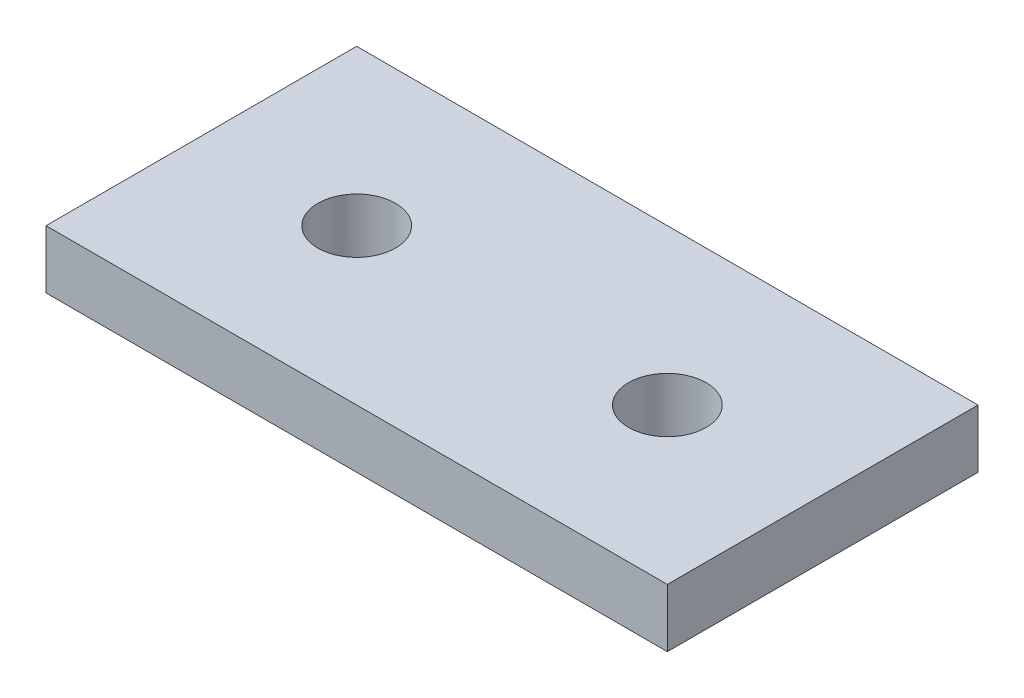
ISO-10303-21;
HEADER;
FILE_DESCRIPTION(('STEP AP214'),'2;1');
FILE_NAME('part.step','',(''),(''),'','','');
FILE_SCHEMA(('AUTOMOTIVE_DESIGN { 1 0 10303 214 1 1 1 1 }'));
ENDSEC;
DATA;
#1=APPLICATION_CONTEXT('core data for automotive mechanical design processes');
#2=APPLICATION_PROTOCOL_DEFINITION('international standard','automotive_design',2000,#1);
#3=PRODUCT_CONTEXT('',#1,'mechanical');
#4=PRODUCT('Part','Part','',(#3));
#5=PRODUCT_RELATED_PRODUCT_CATEGORY('part','',(#4));
#6=PRODUCT_DEFINITION_FORMATION('','',#4);
#7=PRODUCT_DEFINITION_CONTEXT('part definition',#1,'design');
#8=PRODUCT_DEFINITION('design','',#6,#7);
#9=PRODUCT_DEFINITION_SHAPE('','',#8);
#10=(LENGTH_UNIT() NAMED_UNIT(*) SI_UNIT(.MILLI.,.METRE.));
#11=(NAMED_UNIT(*) PLANE_ANGLE_UNIT() SI_UNIT($,.RADIAN.));
#12=(NAMED_UNIT(*) SI_UNIT($,.STERADIAN.) SOLID_ANGLE_UNIT());
#13=UNCERTAINTY_MEASURE_WITH_UNIT(LENGTH_MEASURE(1.E-05),#10,'distance_accuracy_value','');
#14=(GEOMETRIC_REPRESENTATION_CONTEXT(3) GLOBAL_UNCERTAINTY_ASSIGNED_CONTEXT((#13)) GLOBAL_UNIT_ASSIGNED_CONTEXT((#10,
#11,#12)) REPRESENTATION_CONTEXT('',''));
#15=CARTESIAN_POINT('',(0.,0.,0.));
#16=DIRECTION('',(0.,0.,1.));
#17=DIRECTION('',(1.,0.,0.));
#18=AXIS2_PLACEMENT_3D('',#15,#16,#17);
#19=CARTESIAN_POINT('',(25.4,2.38125,12.7));
#20=DIRECTION('',(-1.,0.,0.));
#21=DIRECTION('',(0.,0.,1.));
#22=AXIS2_PLACEMENT_3D('',#19,#20,#21);
#23=PLANE('',#22);
#24=DIRECTION('',(0.,0.,-1.));
#25=VECTOR('',#24,1.);
#26=CARTESIAN_POINT('',(25.4,-2.38125,12.7));
#27=LINE('',#26,#25);
#28=CARTESIAN_POINT('',(25.4,-2.38125,12.7));
#29=VERTEX_POINT('',#28);
#30=CARTESIAN_POINT('',(25.4,-2.38125,-12.7));
#31=VERTEX_POINT('',#30);
#32=EDGE_CURVE('E106',#29,#31,#27,.T.);
#33=ORIENTED_EDGE('',*,*,#32,.T.);
#34=DIRECTION('',(0.,-1.,0.));
#35=VECTOR('',#34,1.);
#36=CARTESIAN_POINT('',(25.4,2.38125,-12.7));
#37=LINE('',#36,#35);
#38=CARTESIAN_POINT('',(25.4,2.38125,-12.7));
#39=VERTEX_POINT('',#38);
#40=EDGE_CURVE('E11',#39,#31,#37,.T.);
#41=ORIENTED_EDGE('',*,*,#40,.F.);
#42=DIRECTION('',(0.,0.,-1.));
#43=VECTOR('',#42,1.);
#44=CARTESIAN_POINT('',(25.4,2.38125,12.7));
#45=LINE('',#44,#43);
#46=CARTESIAN_POINT('',(25.4,2.38125,12.7));
#47=VERTEX_POINT('',#46);
#48=EDGE_CURVE('E90',#47,#39,#45,.T.);
#49=ORIENTED_EDGE('',*,*,#48,.F.);
#50=DIRECTION('',(0.,-1.,0.));
#51=VECTOR('',#50,1.);
#52=CARTESIAN_POINT('',(25.4,2.38125,12.7));
#53=LINE('',#52,#51);
#54=EDGE_CURVE('E102',#47,#29,#53,.T.);
#55=ORIENTED_EDGE('',*,*,#54,.T.);
#56=EDGE_LOOP('',(#33,#41,#49,#55));
#57=FACE_BOUND('',#56,.T.);
#58=ADVANCED_FACE('F38',(#57),#23,.F.);
#59=CARTESIAN_POINT('',(-25.4,2.38125,-12.7));
#60=DIRECTION('',(0.,0.,1.));
#61=DIRECTION('',(1.,0.,0.));
#62=AXIS2_PLACEMENT_3D('',#59,#60,#61);
#63=PLANE('',#62);
#64=DIRECTION('',(-1.,0.,0.));
#65=VECTOR('',#64,1.);
#66=CARTESIAN_POINT('',(-25.4,-2.38125,-12.7));
#67=LINE('',#66,#65);
#68=CARTESIAN_POINT('',(-25.4,-2.38125,-12.7));
#69=VERTEX_POINT('',#68);
#70=EDGE_CURVE('E95',#31,#69,#67,.T.);
#71=ORIENTED_EDGE('',*,*,#70,.T.);
#72=DIRECTION('',(0.,-1.,0.));
#73=VECTOR('',#72,1.);
#74=CARTESIAN_POINT('',(-25.4,2.38125,-12.7));
#75=LINE('',#74,#73);
#76=CARTESIAN_POINT('',(-25.4,2.38125,-12.7));
#77=VERTEX_POINT('',#76);
#78=EDGE_CURVE('E47',#77,#69,#75,.T.);
#79=ORIENTED_EDGE('',*,*,#78,.F.);
#80=DIRECTION('',(-1.,0.,0.));
#81=VECTOR('',#80,1.);
#82=CARTESIAN_POINT('',(-25.4,2.38125,-12.7));
#83=LINE('',#82,#81);
#84=EDGE_CURVE('E85',#39,#77,#83,.T.);
#85=ORIENTED_EDGE('',*,*,#84,.F.);
#86=ORIENTED_EDGE('',*,*,#40,.T.);
#87=EDGE_LOOP('',(#71,#79,#85,#86));
#88=FACE_BOUND('',#87,.T.);
#89=ADVANCED_FACE('F94',(#88),#63,.F.);
#90=CARTESIAN_POINT('',(-25.4,2.38125,12.7));
#91=DIRECTION('',(1.,0.,0.));
#92=DIRECTION('',(0.,0.,-1.));
#93=AXIS2_PLACEMENT_3D('',#90,#91,#92);
#94=PLANE('',#93);
#95=DIRECTION('',(0.,0.,1.));
#96=VECTOR('',#95,1.);
#97=CARTESIAN_POINT('',(-25.4,-2.38125,12.7));
#98=LINE('',#97,#96);
#99=CARTESIAN_POINT('',(-25.4,-2.38125,12.7));
#100=VERTEX_POINT('',#99);
#101=EDGE_CURVE('E72',#69,#100,#98,.T.);
#102=ORIENTED_EDGE('',*,*,#101,.T.);
#103=DIRECTION('',(0.,-1.,0.));
#104=VECTOR('',#103,1.);
#105=CARTESIAN_POINT('',(-25.4,2.38125,12.7));
#106=LINE('',#105,#104);
#107=CARTESIAN_POINT('',(-25.4,2.38125,12.7));
#108=VERTEX_POINT('',#107);
#109=EDGE_CURVE('E97',#108,#100,#106,.T.);
#110=ORIENTED_EDGE('',*,*,#109,.F.);
#111=DIRECTION('',(0.,0.,1.));
#112=VECTOR('',#111,1.);
#113=CARTESIAN_POINT('',(-25.4,2.38125,12.7));
#114=LINE('',#113,#112);
#115=EDGE_CURVE('E88',#77,#108,#114,.T.);
#116=ORIENTED_EDGE('',*,*,#115,.F.);
#117=ORIENTED_EDGE('',*,*,#78,.T.);
#118=EDGE_LOOP('',(#102,#110,#116,#117));
#119=FACE_BOUND('',#118,.T.);
#120=ADVANCED_FACE('F98',(#119),#94,.F.);
#121=CARTESIAN_POINT('',(-25.4,2.38125,12.7));
#122=DIRECTION('',(0.,0.,-1.));
#123=DIRECTION('',(-1.,0.,0.));
#124=AXIS2_PLACEMENT_3D('',#121,#122,#123);
#125=PLANE('',#124);
#126=DIRECTION('',(1.,0.,0.));
#127=VECTOR('',#126,1.);
#128=CARTESIAN_POINT('',(-25.4,-2.38125,12.7));
#129=LINE('',#128,#127);
#130=EDGE_CURVE('E78',#100,#29,#129,.T.);
#131=ORIENTED_EDGE('',*,*,#130,.T.);
#132=ORIENTED_EDGE('',*,*,#54,.F.);
#133=DIRECTION('',(1.,0.,0.));
#134=VECTOR('',#133,1.);
#135=CARTESIAN_POINT('',(-25.4,2.38125,12.7));
#136=LINE('',#135,#134);
#137=EDGE_CURVE('E55',#108,#47,#136,.T.);
#138=ORIENTED_EDGE('',*,*,#137,.F.);
#139=ORIENTED_EDGE('',*,*,#109,.T.);
#140=EDGE_LOOP('',(#131,#132,#138,#139));
#141=FACE_BOUND('',#140,.T.);
#142=ADVANCED_FACE('F120',(#141),#125,.F.);
#143=CARTESIAN_POINT('',(0.,2.38125,0.));
#144=DIRECTION('',(0.,-1.,0.));
#145=DIRECTION('',(0.,0.,-1.));
#146=AXIS2_PLACEMENT_3D('',#143,#144,#145);
#147=PLANE('',#146);
#148=CARTESIAN_POINT('',(-12.7,2.38125,0.));
#149=DIRECTION('',(0.,1.,0.));
#150=DIRECTION('',(0.,0.,1.));
#151=AXIS2_PLACEMENT_3D('',#148,#149,#150);
#152=CIRCLE('',#151,3.175);
#153=CARTESIAN_POINT('',(-12.7,2.38125,3.175));
#154=VERTEX_POINT('',#153);
#155=EDGE_CURVE('E110',#154,#154,#152,.T.);
#156=ORIENTED_EDGE('',*,*,#155,.F.);
#157=EDGE_LOOP('',(#156));
#158=FACE_BOUND('',#157,.T.);
#159=CARTESIAN_POINT('',(12.7,2.38125,0.));
#160=DIRECTION('',(0.,1.,0.));
#161=DIRECTION('',(0.,0.,-1.));
#162=AXIS2_PLACEMENT_3D('',#159,#160,#161);
#163=CIRCLE('',#162,3.175);
#164=CARTESIAN_POINT('',(12.7,2.38125,-3.175));
#165=VERTEX_POINT('',#164);
#166=EDGE_CURVE('E131',#165,#165,#163,.T.);
#167=ORIENTED_EDGE('',*,*,#166,.F.);
#168=EDGE_LOOP('',(#167));
#169=FACE_BOUND('',#168,.T.);
#170=ORIENTED_EDGE('',*,*,#48,.T.);
#171=ORIENTED_EDGE('',*,*,#84,.T.);
#172=ORIENTED_EDGE('',*,*,#115,.T.);
#173=ORIENTED_EDGE('',*,*,#137,.T.);
#174=EDGE_LOOP('',(#170,#171,#172,#173));
#175=FACE_BOUND('',#174,.T.);
#176=ADVANCED_FACE('F86',(#158,#169,#175),#147,.F.);
#177=CARTESIAN_POINT('',(0.,-2.38125,0.));
#178=DIRECTION('',(0.,-1.,0.));
#179=DIRECTION('',(0.,0.,-1.));
#180=AXIS2_PLACEMENT_3D('',#177,#178,#179);
#181=PLANE('',#180);
#182=CARTESIAN_POINT('',(-12.7,-2.38125,0.));
#183=DIRECTION('',(0.,-1.,0.));
#184=DIRECTION('',(0.,0.,-1.));
#185=AXIS2_PLACEMENT_3D('',#182,#183,#184);
#186=CIRCLE('',#185,3.175);
#187=CARTESIAN_POINT('',(-12.7,-2.38125,-3.175));
#188=VERTEX_POINT('',#187);
#189=EDGE_CURVE('E135',#188,#188,#186,.F.);
#190=ORIENTED_EDGE('',*,*,#189,.T.);
#191=EDGE_LOOP('',(#190));
#192=FACE_BOUND('',#191,.T.);
#193=CARTESIAN_POINT('',(12.7,-2.38125,0.));
#194=DIRECTION('',(0.,-1.,0.));
#195=DIRECTION('',(0.,0.,-1.));
#196=AXIS2_PLACEMENT_3D('',#193,#194,#195);
#197=CIRCLE('',#196,3.175);
#198=CARTESIAN_POINT('',(12.7,-2.38125,-3.175));
#199=VERTEX_POINT('',#198);
#200=EDGE_CURVE('E127',#199,#199,#197,.F.);
#201=ORIENTED_EDGE('',*,*,#200,.T.);
#202=EDGE_LOOP('',(#201));
#203=FACE_BOUND('',#202,.T.);
#204=ORIENTED_EDGE('',*,*,#32,.F.);
#205=ORIENTED_EDGE('',*,*,#130,.F.);
#206=ORIENTED_EDGE('',*,*,#101,.F.);
#207=ORIENTED_EDGE('',*,*,#70,.F.);
#208=EDGE_LOOP('',(#204,#205,#206,#207));
#209=FACE_BOUND('',#208,.T.);
#210=ADVANCED_FACE('F123',(#192,#203,#209),#181,.T.);
#211=CARTESIAN_POINT('',(12.7,-2.38225,0.));
#212=DIRECTION('',(0.,1.,0.));
#213=DIRECTION('',(0.,0.,1.));
#214=AXIS2_PLACEMENT_3D('',#211,#212,#213);
#215=CYLINDRICAL_SURFACE('',#214,3.175);
#216=ORIENTED_EDGE('',*,*,#200,.F.);
#217=EDGE_LOOP('',(#216));
#218=FACE_BOUND('',#217,.T.);
#219=ORIENTED_EDGE('',*,*,#166,.T.);
#220=EDGE_LOOP('',(#219));
#221=FACE_BOUND('',#220,.T.);
#222=ADVANCED_FACE('F150',(#218,#221),#215,.F.);
#223=CARTESIAN_POINT('',(-12.7,-2.38225,0.));
#224=DIRECTION('',(0.,1.,0.));
#225=DIRECTION('',(0.,0.,1.));
#226=AXIS2_PLACEMENT_3D('',#223,#224,#225);
#227=CYLINDRICAL_SURFACE('',#226,3.175);
#228=ORIENTED_EDGE('',*,*,#189,.F.);
#229=EDGE_LOOP('',(#228));
#230=FACE_BOUND('',#229,.T.);
#231=ORIENTED_EDGE('',*,*,#155,.T.);
#232=EDGE_LOOP('',(#231));
#233=FACE_BOUND('',#232,.T.);
#234=ADVANCED_FACE('F143',(#230,#233),#227,.F.);
#235=CLOSED_SHELL('',(#58,#89,#120,#142,#176,#210,#222,#234));
#236=MANIFOLD_SOLID_BREP('B2',#235);
#237=ADVANCED_BREP_SHAPE_REPRESENTATION('',(#18,#236),#14);
#238=SHAPE_DEFINITION_REPRESENTATION(#9,#237);
ENDSEC;
END-ISO-10303-21;
